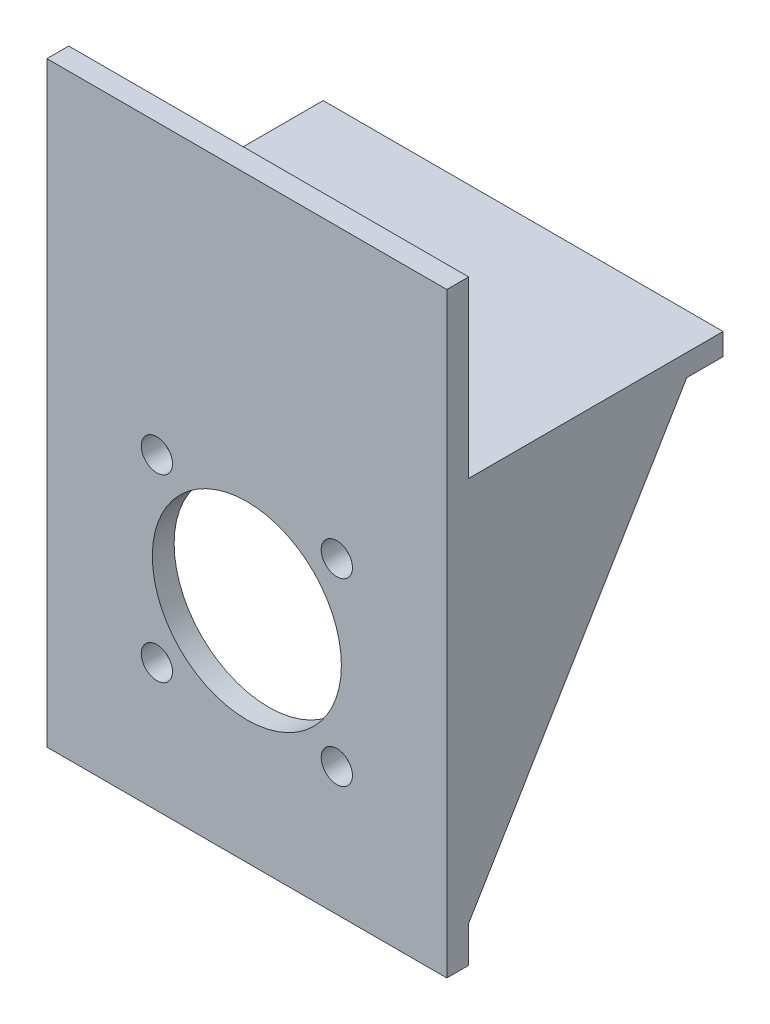
ISO-10303-21;
HEADER;
FILE_DESCRIPTION(('STEP AP214'),'2;1');
FILE_NAME('part.step','',(''),(''),'','','');
FILE_SCHEMA(('AUTOMOTIVE_DESIGN { 1 0 10303 214 1 1 1 1 }'));
ENDSEC;
DATA;
#1=APPLICATION_CONTEXT('core data for automotive mechanical design processes');
#2=APPLICATION_PROTOCOL_DEFINITION('international standard','automotive_design',2000,#1);
#3=PRODUCT_CONTEXT('',#1,'mechanical');
#4=PRODUCT('Part','Part','',(#3));
#5=PRODUCT_RELATED_PRODUCT_CATEGORY('part','',(#4));
#6=PRODUCT_DEFINITION_FORMATION('','',#4);
#7=PRODUCT_DEFINITION_CONTEXT('part definition',#1,'design');
#8=PRODUCT_DEFINITION('design','',#6,#7);
#9=PRODUCT_DEFINITION_SHAPE('','',#8);
#10=(LENGTH_UNIT() NAMED_UNIT(*) SI_UNIT(.MILLI.,.METRE.));
#11=(NAMED_UNIT(*) PLANE_ANGLE_UNIT() SI_UNIT($,.RADIAN.));
#12=(NAMED_UNIT(*) SI_UNIT($,.STERADIAN.) SOLID_ANGLE_UNIT());
#13=UNCERTAINTY_MEASURE_WITH_UNIT(LENGTH_MEASURE(1.E-05),#10,'distance_accuracy_value','');
#14=(GEOMETRIC_REPRESENTATION_CONTEXT(3) GLOBAL_UNCERTAINTY_ASSIGNED_CONTEXT((#13)) GLOBAL_UNIT_ASSIGNED_CONTEXT((#10,
#11,#12)) REPRESENTATION_CONTEXT('',''));
#15=CARTESIAN_POINT('',(0.,0.,0.));
#16=DIRECTION('',(0.,0.,1.));
#17=DIRECTION('',(1.,0.,0.));
#18=AXIS2_PLACEMENT_3D('',#15,#16,#17);
#19=CARTESIAN_POINT('',(-27.5,3.,-17.5));
#20=DIRECTION('',(1.,0.,0.));
#21=DIRECTION('',(0.,0.,-1.));
#22=AXIS2_PLACEMENT_3D('',#19,#20,#21);
#23=PLANE('',#22);
#24=DIRECTION('',(0.,0.,1.));
#25=VECTOR('',#24,1.);
#26=CARTESIAN_POINT('',(-27.5,0.,-17.5));
#27=LINE('',#26,#25);
#28=CARTESIAN_POINT('',(-27.5,0.,-17.5));
#29=VERTEX_POINT('',#28);
#30=CARTESIAN_POINT('',(-27.5,0.,-12.5));
#31=VERTEX_POINT('',#30);
#32=EDGE_CURVE('E217',#29,#31,#27,.T.);
#33=ORIENTED_EDGE('',*,*,#32,.T.);
#34=DIRECTION('',(0.,-0.857492925712544,0.514495755427526));
#35=VECTOR('',#34,1.);
#36=CARTESIAN_POINT('',(-27.5,-50.,17.5));
#37=LINE('',#36,#35);
#38=CARTESIAN_POINT('',(-27.5,-50.,17.5));
#39=VERTEX_POINT('',#38);
#40=EDGE_CURVE('E50',#31,#39,#37,.T.);
#41=ORIENTED_EDGE('',*,*,#40,.T.);
#42=DIRECTION('',(0.,-1.,0.));
#43=VECTOR('',#42,1.);
#44=CARTESIAN_POINT('',(-27.5,27.,17.5));
#45=LINE('',#44,#43);
#46=CARTESIAN_POINT('',(-27.5,-55.,17.5));
#47=VERTEX_POINT('',#46);
#48=EDGE_CURVE('E152',#39,#47,#45,.T.);
#49=ORIENTED_EDGE('',*,*,#48,.T.);
#50=DIRECTION('',(0.,0.,-1.));
#51=VECTOR('',#50,1.);
#52=CARTESIAN_POINT('',(-27.5,-55.,20.5));
#53=LINE('',#52,#51);
#54=CARTESIAN_POINT('',(-27.5,-55.,20.5));
#55=VERTEX_POINT('',#54);
#56=EDGE_CURVE('E196',#55,#47,#53,.T.);
#57=ORIENTED_EDGE('',*,*,#56,.F.);
#58=DIRECTION('',(0.,-1.,0.));
#59=VECTOR('',#58,1.);
#60=CARTESIAN_POINT('',(-27.5,27.,20.5));
#61=LINE('',#60,#59);
#62=CARTESIAN_POINT('',(-27.5,27.,20.5));
#63=VERTEX_POINT('',#62);
#64=EDGE_CURVE('E174',#63,#55,#61,.T.);
#65=ORIENTED_EDGE('',*,*,#64,.F.);
#66=DIRECTION('',(0.,0.,-1.));
#67=VECTOR('',#66,1.);
#68=CARTESIAN_POINT('',(-27.5,27.,20.5));
#69=LINE('',#68,#67);
#70=CARTESIAN_POINT('',(-27.5,27.,17.5));
#71=VERTEX_POINT('',#70);
#72=EDGE_CURVE('E184',#63,#71,#69,.T.);
#73=ORIENTED_EDGE('',*,*,#72,.T.);
#74=CARTESIAN_POINT('',(-27.5,3.,17.5));
#75=VERTEX_POINT('',#74);
#76=EDGE_CURVE('E192',#71,#75,#45,.T.);
#77=ORIENTED_EDGE('',*,*,#76,.T.);
#78=DIRECTION('',(0.,0.,1.));
#79=VECTOR('',#78,1.);
#80=CARTESIAN_POINT('',(-27.5,3.,-17.5));
#81=LINE('',#80,#79);
#82=CARTESIAN_POINT('',(-27.5,3.,-17.5));
#83=VERTEX_POINT('',#82);
#84=EDGE_CURVE('E232',#83,#75,#81,.T.);
#85=ORIENTED_EDGE('',*,*,#84,.F.);
#86=DIRECTION('',(0.,-1.,0.));
#87=VECTOR('',#86,1.);
#88=CARTESIAN_POINT('',(-27.5,3.,-17.5));
#89=LINE('',#88,#87);
#90=EDGE_CURVE('E42',#83,#29,#89,.T.);
#91=ORIENTED_EDGE('',*,*,#90,.T.);
#92=EDGE_LOOP('',(#33,#41,#49,#57,#65,#73,#77,#85,#91));
#93=FACE_BOUND('',#92,.T.);
#94=ADVANCED_FACE('F33',(#93),#23,.F.);
#95=CARTESIAN_POINT('',(27.5,3.,-17.5));
#96=DIRECTION('',(-1.,0.,0.));
#97=DIRECTION('',(0.,0.,1.));
#98=AXIS2_PLACEMENT_3D('',#95,#96,#97);
#99=PLANE('',#98);
#100=DIRECTION('',(0.,0.857492925712544,-0.514495755427526));
#101=VECTOR('',#100,1.);
#102=CARTESIAN_POINT('',(27.5,0.,-12.5));
#103=LINE('',#102,#101);
#104=CARTESIAN_POINT('',(27.5,-50.,17.5));
#105=VERTEX_POINT('',#104);
#106=CARTESIAN_POINT('',(27.5,0.,-12.5));
#107=VERTEX_POINT('',#106);
#108=EDGE_CURVE('E154',#105,#107,#103,.T.);
#109=ORIENTED_EDGE('',*,*,#108,.T.);
#110=DIRECTION('',(0.,0.,-1.));
#111=VECTOR('',#110,1.);
#112=CARTESIAN_POINT('',(27.5,0.,-17.5));
#113=LINE('',#112,#111);
#114=CARTESIAN_POINT('',(27.5,0.,-17.5));
#115=VERTEX_POINT('',#114);
#116=EDGE_CURVE('E222',#107,#115,#113,.T.);
#117=ORIENTED_EDGE('',*,*,#116,.T.);
#118=DIRECTION('',(0.,-1.,0.));
#119=VECTOR('',#118,1.);
#120=CARTESIAN_POINT('',(27.5,3.,-17.5));
#121=LINE('',#120,#119);
#122=CARTESIAN_POINT('',(27.5,3.,-17.5));
#123=VERTEX_POINT('',#122);
#124=EDGE_CURVE('E11',#123,#115,#121,.T.);
#125=ORIENTED_EDGE('',*,*,#124,.F.);
#126=DIRECTION('',(0.,0.,-1.));
#127=VECTOR('',#126,1.);
#128=CARTESIAN_POINT('',(27.5,3.,-17.5));
#129=LINE('',#128,#127);
#130=CARTESIAN_POINT('',(27.5,3.,17.5));
#131=VERTEX_POINT('',#130);
#132=EDGE_CURVE('E240',#131,#123,#129,.T.);
#133=ORIENTED_EDGE('',*,*,#132,.F.);
#134=DIRECTION('',(0.,1.,0.));
#135=VECTOR('',#134,1.);
#136=CARTESIAN_POINT('',(27.5,27.,17.5));
#137=LINE('',#136,#135);
#138=CARTESIAN_POINT('',(27.5,27.,17.5));
#139=VERTEX_POINT('',#138);
#140=EDGE_CURVE('E79',#131,#139,#137,.T.);
#141=ORIENTED_EDGE('',*,*,#140,.T.);
#142=DIRECTION('',(0.,0.,-1.));
#143=VECTOR('',#142,1.);
#144=CARTESIAN_POINT('',(27.5,27.,20.5));
#145=LINE('',#144,#143);
#146=CARTESIAN_POINT('',(27.5,27.,20.5));
#147=VERTEX_POINT('',#146);
#148=EDGE_CURVE('E208',#147,#139,#145,.T.);
#149=ORIENTED_EDGE('',*,*,#148,.F.);
#150=DIRECTION('',(0.,1.,0.));
#151=VECTOR('',#150,1.);
#152=CARTESIAN_POINT('',(27.5,27.,20.5));
#153=LINE('',#152,#151);
#154=CARTESIAN_POINT('',(27.5,-55.,20.5));
#155=VERTEX_POINT('',#154);
#156=EDGE_CURVE('E180',#155,#147,#153,.T.);
#157=ORIENTED_EDGE('',*,*,#156,.F.);
#158=DIRECTION('',(0.,0.,-1.));
#159=VECTOR('',#158,1.);
#160=CARTESIAN_POINT('',(27.5,-55.,20.5));
#161=LINE('',#160,#159);
#162=CARTESIAN_POINT('',(27.5,-55.,17.5));
#163=VERTEX_POINT('',#162);
#164=EDGE_CURVE('E210',#155,#163,#161,.T.);
#165=ORIENTED_EDGE('',*,*,#164,.T.);
#166=EDGE_CURVE('E198',#163,#105,#137,.T.);
#167=ORIENTED_EDGE('',*,*,#166,.T.);
#168=EDGE_LOOP('',(#109,#117,#125,#133,#141,#149,#157,#165,#167));
#169=FACE_BOUND('',#168,.T.);
#170=ADVANCED_FACE('F245',(#169),#99,.F.);
#171=CARTESIAN_POINT('',(-27.5,3.,-17.5));
#172=DIRECTION('',(0.,0.,1.));
#173=DIRECTION('',(1.,0.,0.));
#174=AXIS2_PLACEMENT_3D('',#171,#172,#173);
#175=PLANE('',#174);
#176=DIRECTION('',(-1.,0.,0.));
#177=VECTOR('',#176,1.);
#178=CARTESIAN_POINT('',(-27.5,0.,-17.5));
#179=LINE('',#178,#177);
#180=EDGE_CURVE('E72',#115,#29,#179,.T.);
#181=ORIENTED_EDGE('',*,*,#180,.T.);
#182=ORIENTED_EDGE('',*,*,#90,.F.);
#183=DIRECTION('',(-1.,0.,0.));
#184=VECTOR('',#183,1.);
#185=CARTESIAN_POINT('',(-27.5,3.,-17.5));
#186=LINE('',#185,#184);
#187=EDGE_CURVE('E59',#123,#83,#186,.T.);
#188=ORIENTED_EDGE('',*,*,#187,.F.);
#189=ORIENTED_EDGE('',*,*,#124,.T.);
#190=EDGE_LOOP('',(#181,#182,#188,#189));
#191=FACE_BOUND('',#190,.T.);
#192=ADVANCED_FACE('F246',(#191),#175,.F.);
#193=CARTESIAN_POINT('',(0.,3.,0.));
#194=DIRECTION('',(0.,1.,0.));
#195=DIRECTION('',(0.,0.,1.));
#196=AXIS2_PLACEMENT_3D('',#193,#194,#195);
#197=PLANE('',#196);
#198=ORIENTED_EDGE('',*,*,#84,.T.);
#199=DIRECTION('',(1.,0.,0.));
#200=VECTOR('',#199,1.);
#201=CARTESIAN_POINT('',(-27.5,3.,17.5));
#202=LINE('',#201,#200);
#203=EDGE_CURVE('E234',#75,#131,#202,.T.);
#204=ORIENTED_EDGE('',*,*,#203,.T.);
#205=ORIENTED_EDGE('',*,*,#132,.T.);
#206=ORIENTED_EDGE('',*,*,#187,.T.);
#207=EDGE_LOOP('',(#198,#204,#205,#206));
#208=FACE_BOUND('',#207,.T.);
#209=ADVANCED_FACE('F244',(#208),#197,.T.);
#210=CARTESIAN_POINT('',(0.,0.,0.));
#211=DIRECTION('',(0.,1.,0.));
#212=DIRECTION('',(0.,0.,1.));
#213=AXIS2_PLACEMENT_3D('',#210,#211,#212);
#214=PLANE('',#213);
#215=DIRECTION('',(0.,0.,-1.));
#216=VECTOR('',#215,1.);
#217=CARTESIAN_POINT('',(-24.5,0.,-12.5));
#218=LINE('',#217,#216);
#219=CARTESIAN_POINT('',(-24.5,0.,17.5));
#220=VERTEX_POINT('',#219);
#221=CARTESIAN_POINT('',(-24.5,0.,-12.5));
#222=VERTEX_POINT('',#221);
#223=EDGE_CURVE('E138',#220,#222,#218,.T.);
#224=ORIENTED_EDGE('',*,*,#223,.T.);
#225=DIRECTION('',(-1.,0.,0.));
#226=VECTOR('',#225,1.);
#227=CARTESIAN_POINT('',(-24.5,0.,-12.5));
#228=LINE('',#227,#226);
#229=EDGE_CURVE('E148',#222,#31,#228,.T.);
#230=ORIENTED_EDGE('',*,*,#229,.T.);
#231=ORIENTED_EDGE('',*,*,#32,.F.);
#232=ORIENTED_EDGE('',*,*,#180,.F.);
#233=ORIENTED_EDGE('',*,*,#116,.F.);
#234=DIRECTION('',(1.,0.,0.));
#235=VECTOR('',#234,1.);
#236=CARTESIAN_POINT('',(24.5,0.,-12.5));
#237=LINE('',#236,#235);
#238=CARTESIAN_POINT('',(24.5,0.,-12.5));
#239=VERTEX_POINT('',#238);
#240=EDGE_CURVE('E170',#239,#107,#237,.T.);
#241=ORIENTED_EDGE('',*,*,#240,.F.);
#242=DIRECTION('',(0.,0.,1.));
#243=VECTOR('',#242,1.);
#244=CARTESIAN_POINT('',(24.5,0.,17.5));
#245=LINE('',#244,#243);
#246=CARTESIAN_POINT('',(24.5,0.,17.5));
#247=VERTEX_POINT('',#246);
#248=EDGE_CURVE('E164',#239,#247,#245,.T.);
#249=ORIENTED_EDGE('',*,*,#248,.T.);
#250=DIRECTION('',(1.,0.,0.));
#251=VECTOR('',#250,1.);
#252=CARTESIAN_POINT('',(-27.5,0.,17.5));
#253=LINE('',#252,#251);
#254=EDGE_CURVE('E36',#220,#247,#253,.T.);
#255=ORIENTED_EDGE('',*,*,#254,.F.);
#256=EDGE_LOOP('',(#224,#230,#231,#232,#233,#241,#249,#255));
#257=FACE_BOUND('',#256,.T.);
#258=ADVANCED_FACE('F260',(#257),#214,.F.);
#259=CARTESIAN_POINT('',(0.,0.,17.5));
#260=DIRECTION('',(0.,0.,1.));
#261=DIRECTION('',(1.,0.,0.));
#262=AXIS2_PLACEMENT_3D('',#259,#260,#261);
#263=PLANE('',#262);
#264=CARTESIAN_POINT('',(12.3743686707645,-12.6256313292361,17.5));
#265=DIRECTION('',(0.,0.,-1.));
#266=DIRECTION('',(-1.,0.,0.));
#267=AXIS2_PLACEMENT_3D('',#264,#265,#266);
#268=CIRCLE('',#267,2.15);
#269=CARTESIAN_POINT('',(10.2243686707645,-12.6256313292361,17.5));
#270=VERTEX_POINT('',#269);
#271=EDGE_CURVE('E335',#270,#270,#268,.T.);
#272=ORIENTED_EDGE('',*,*,#271,.F.);
#273=EDGE_LOOP('',(#272));
#274=FACE_BOUND('',#273,.T.);
#275=CARTESIAN_POINT('',(12.3743686707639,-37.3743686707653,17.5));
#276=DIRECTION('',(0.,0.,-1.));
#277=DIRECTION('',(-1.,0.,0.));
#278=AXIS2_PLACEMENT_3D('',#275,#276,#277);
#279=CIRCLE('',#278,2.15);
#280=CARTESIAN_POINT('',(10.2243686707639,-37.3743686707653,17.5));
#281=VERTEX_POINT('',#280);
#282=EDGE_CURVE('E331',#281,#281,#279,.T.);
#283=ORIENTED_EDGE('',*,*,#282,.F.);
#284=EDGE_LOOP('',(#283));
#285=FACE_BOUND('',#284,.T.);
#286=CARTESIAN_POINT('',(-12.3743686707653,-37.3743686707646,17.5));
#287=DIRECTION('',(0.,0.,-1.));
#288=DIRECTION('',(-1.,0.,0.));
#289=AXIS2_PLACEMENT_3D('',#286,#287,#288);
#290=CIRCLE('',#289,2.15);
#291=CARTESIAN_POINT('',(-14.5243686707653,-37.3743686707646,17.5));
#292=VERTEX_POINT('',#291);
#293=EDGE_CURVE('E327',#292,#292,#290,.T.);
#294=ORIENTED_EDGE('',*,*,#293,.F.);
#295=EDGE_LOOP('',(#294));
#296=FACE_BOUND('',#295,.T.);
#297=CARTESIAN_POINT('',(-12.3743686707645,-12.6256313292353,17.5));
#298=DIRECTION('',(0.,0.,-1.));
#299=DIRECTION('',(-1.,0.,0.));
#300=AXIS2_PLACEMENT_3D('',#297,#298,#299);
#301=CIRCLE('',#300,2.15);
#302=CARTESIAN_POINT('',(-14.5243686707645,-12.6256313292353,17.5));
#303=VERTEX_POINT('',#302);
#304=EDGE_CURVE('E323',#303,#303,#301,.T.);
#305=ORIENTED_EDGE('',*,*,#304,.F.);
#306=EDGE_LOOP('',(#305));
#307=FACE_BOUND('',#306,.T.);
#308=CARTESIAN_POINT('',(0.,-25.,17.5));
#309=DIRECTION('',(0.,0.,-1.));
#310=DIRECTION('',(-1.,0.,0.));
#311=AXIS2_PLACEMENT_3D('',#308,#309,#310);
#312=CIRCLE('',#311,13.);
#313=CARTESIAN_POINT('',(-13.,-25.,17.5));
#314=VERTEX_POINT('',#313);
#315=EDGE_CURVE('E318',#314,#314,#312,.T.);
#316=ORIENTED_EDGE('',*,*,#315,.F.);
#317=EDGE_LOOP('',(#316));
#318=FACE_BOUND('',#317,.T.);
#319=ORIENTED_EDGE('',*,*,#48,.F.);
#320=DIRECTION('',(-1.,0.,0.));
#321=VECTOR('',#320,1.);
#322=CARTESIAN_POINT('',(-24.5,-50.,17.5));
#323=LINE('',#322,#321);
#324=CARTESIAN_POINT('',(-24.5,-50.,17.5));
#325=VERTEX_POINT('',#324);
#326=EDGE_CURVE('E145',#325,#39,#323,.T.);
#327=ORIENTED_EDGE('',*,*,#326,.F.);
#328=DIRECTION('',(0.,1.,0.));
#329=VECTOR('',#328,1.);
#330=CARTESIAN_POINT('',(-24.5,0.,17.5));
#331=LINE('',#330,#329);
#332=EDGE_CURVE('E133',#325,#220,#331,.T.);
#333=ORIENTED_EDGE('',*,*,#332,.T.);
#334=ORIENTED_EDGE('',*,*,#254,.T.);
#335=DIRECTION('',(0.,-1.,0.));
#336=VECTOR('',#335,1.);
#337=CARTESIAN_POINT('',(24.5,-50.,17.5));
#338=LINE('',#337,#336);
#339=CARTESIAN_POINT('',(24.5,-50.,17.5));
#340=VERTEX_POINT('',#339);
#341=EDGE_CURVE('E159',#247,#340,#338,.T.);
#342=ORIENTED_EDGE('',*,*,#341,.T.);
#343=DIRECTION('',(1.,0.,0.));
#344=VECTOR('',#343,1.);
#345=CARTESIAN_POINT('',(24.5,-50.,17.5));
#346=LINE('',#345,#344);
#347=EDGE_CURVE('E167',#340,#105,#346,.T.);
#348=ORIENTED_EDGE('',*,*,#347,.T.);
#349=ORIENTED_EDGE('',*,*,#166,.F.);
#350=DIRECTION('',(1.,0.,0.));
#351=VECTOR('',#350,1.);
#352=CARTESIAN_POINT('',(-27.5,-55.,17.5));
#353=LINE('',#352,#351);
#354=EDGE_CURVE('E187',#47,#163,#353,.T.);
#355=ORIENTED_EDGE('',*,*,#354,.F.);
#356=EDGE_LOOP('',(#319,#327,#333,#334,#342,#348,#349,#355));
#357=FACE_BOUND('',#356,.T.);
#358=ADVANCED_FACE('F150',(#274,#285,#296,#307,#318,#357),#263,.F.);
#359=CARTESIAN_POINT('',(-27.5,-55.,20.5));
#360=DIRECTION('',(0.,1.,0.));
#361=DIRECTION('',(0.,0.,1.));
#362=AXIS2_PLACEMENT_3D('',#359,#360,#361);
#363=PLANE('',#362);
#364=ORIENTED_EDGE('',*,*,#354,.T.);
#365=ORIENTED_EDGE('',*,*,#164,.F.);
#366=DIRECTION('',(1.,0.,0.));
#367=VECTOR('',#366,1.);
#368=CARTESIAN_POINT('',(-27.5,-55.,20.5));
#369=LINE('',#368,#367);
#370=EDGE_CURVE('E177',#55,#155,#369,.T.);
#371=ORIENTED_EDGE('',*,*,#370,.F.);
#372=ORIENTED_EDGE('',*,*,#56,.T.);
#373=EDGE_LOOP('',(#364,#365,#371,#372));
#374=FACE_BOUND('',#373,.T.);
#375=ADVANCED_FACE('F256',(#374),#363,.F.);
#376=CARTESIAN_POINT('',(-27.5,27.,20.5));
#377=DIRECTION('',(0.,-1.,0.));
#378=DIRECTION('',(0.,0.,-1.));
#379=AXIS2_PLACEMENT_3D('',#376,#377,#378);
#380=PLANE('',#379);
#381=DIRECTION('',(-1.,0.,0.));
#382=VECTOR('',#381,1.);
#383=CARTESIAN_POINT('',(-27.5,27.,17.5));
#384=LINE('',#383,#382);
#385=EDGE_CURVE('E178',#139,#71,#384,.T.);
#386=ORIENTED_EDGE('',*,*,#385,.T.);
#387=ORIENTED_EDGE('',*,*,#72,.F.);
#388=DIRECTION('',(-1.,0.,0.));
#389=VECTOR('',#388,1.);
#390=CARTESIAN_POINT('',(-27.5,27.,20.5));
#391=LINE('',#390,#389);
#392=EDGE_CURVE('E182',#147,#63,#391,.T.);
#393=ORIENTED_EDGE('',*,*,#392,.F.);
#394=ORIENTED_EDGE('',*,*,#148,.T.);
#395=EDGE_LOOP('',(#386,#387,#393,#394));
#396=FACE_BOUND('',#395,.T.);
#397=ADVANCED_FACE('F253',(#396),#380,.F.);
#398=CARTESIAN_POINT('',(0.,0.,20.5));
#399=DIRECTION('',(0.,0.,1.));
#400=DIRECTION('',(1.,0.,0.));
#401=AXIS2_PLACEMENT_3D('',#398,#399,#400);
#402=PLANE('',#401);
#403=CARTESIAN_POINT('',(12.3743686707645,-12.6256313292361,20.5));
#404=DIRECTION('',(0.,0.,-1.));
#405=DIRECTION('',(-1.,0.,0.));
#406=AXIS2_PLACEMENT_3D('',#403,#404,#405);
#407=CIRCLE('',#406,2.15);
#408=CARTESIAN_POINT('',(10.2243686707645,-12.6256313292361,20.5));
#409=VERTEX_POINT('',#408);
#410=EDGE_CURVE('E300',#409,#409,#407,.T.);
#411=ORIENTED_EDGE('',*,*,#410,.T.);
#412=EDGE_LOOP('',(#411));
#413=FACE_BOUND('',#412,.T.);
#414=CARTESIAN_POINT('',(12.3743686707639,-37.3743686707653,20.5));
#415=DIRECTION('',(0.,0.,-1.));
#416=DIRECTION('',(-1.,0.,0.));
#417=AXIS2_PLACEMENT_3D('',#414,#415,#416);
#418=CIRCLE('',#417,2.15);
#419=CARTESIAN_POINT('',(10.2243686707639,-37.3743686707653,20.5));
#420=VERTEX_POINT('',#419);
#421=EDGE_CURVE('E304',#420,#420,#418,.T.);
#422=ORIENTED_EDGE('',*,*,#421,.T.);
#423=EDGE_LOOP('',(#422));
#424=FACE_BOUND('',#423,.T.);
#425=CARTESIAN_POINT('',(-12.3743686707653,-37.3743686707646,20.5));
#426=DIRECTION('',(0.,0.,-1.));
#427=DIRECTION('',(-1.,0.,0.));
#428=AXIS2_PLACEMENT_3D('',#425,#426,#427);
#429=CIRCLE('',#428,2.15);
#430=CARTESIAN_POINT('',(-14.5243686707653,-37.3743686707646,20.5));
#431=VERTEX_POINT('',#430);
#432=EDGE_CURVE('E308',#431,#431,#429,.T.);
#433=ORIENTED_EDGE('',*,*,#432,.T.);
#434=EDGE_LOOP('',(#433));
#435=FACE_BOUND('',#434,.T.);
#436=CARTESIAN_POINT('',(-12.3743686707645,-12.6256313292353,20.5));
#437=DIRECTION('',(0.,0.,-1.));
#438=DIRECTION('',(-1.,0.,0.));
#439=AXIS2_PLACEMENT_3D('',#436,#437,#438);
#440=CIRCLE('',#439,2.15);
#441=CARTESIAN_POINT('',(-14.5243686707645,-12.6256313292353,20.5));
#442=VERTEX_POINT('',#441);
#443=EDGE_CURVE('E312',#442,#442,#440,.T.);
#444=ORIENTED_EDGE('',*,*,#443,.T.);
#445=EDGE_LOOP('',(#444));
#446=FACE_BOUND('',#445,.T.);
#447=CARTESIAN_POINT('',(0.,-25.,20.5));
#448=DIRECTION('',(0.,0.,-1.));
#449=DIRECTION('',(-1.,0.,0.));
#450=AXIS2_PLACEMENT_3D('',#447,#448,#449);
#451=CIRCLE('',#450,13.);
#452=CARTESIAN_POINT('',(-13.,-25.,20.5));
#453=VERTEX_POINT('',#452);
#454=EDGE_CURVE('E316',#453,#453,#451,.T.);
#455=ORIENTED_EDGE('',*,*,#454,.T.);
#456=EDGE_LOOP('',(#455));
#457=FACE_BOUND('',#456,.T.);
#458=ORIENTED_EDGE('',*,*,#64,.T.);
#459=ORIENTED_EDGE('',*,*,#370,.T.);
#460=ORIENTED_EDGE('',*,*,#156,.T.);
#461=ORIENTED_EDGE('',*,*,#392,.T.);
#462=EDGE_LOOP('',(#458,#459,#460,#461));
#463=FACE_BOUND('',#462,.T.);
#464=ADVANCED_FACE('F274',(#413,#424,#435,#446,#457,#463),#402,.T.);
#465=ORIENTED_EDGE('',*,*,#203,.F.);
#466=ORIENTED_EDGE('',*,*,#76,.F.);
#467=ORIENTED_EDGE('',*,*,#385,.F.);
#468=ORIENTED_EDGE('',*,*,#140,.F.);
#469=EDGE_LOOP('',(#465,#466,#467,#468));
#470=FACE_BOUND('',#469,.T.);
#471=ADVANCED_FACE('F251',(#470),#263,.F.);
#472=CARTESIAN_POINT('',(24.5,0.,-12.5));
#473=DIRECTION('',(0.,-0.514495755427527,-0.857492925712544));
#474=DIRECTION('',(0.,0.857492925712544,-0.514495755427527));
#475=AXIS2_PLACEMENT_3D('',#472,#473,#474);
#476=PLANE('',#475);
#477=ORIENTED_EDGE('',*,*,#108,.F.);
#478=ORIENTED_EDGE('',*,*,#347,.F.);
#479=DIRECTION('',(0.,0.857492925712544,-0.514495755427526));
#480=VECTOR('',#479,1.);
#481=CARTESIAN_POINT('',(24.5,0.,-12.5));
#482=LINE('',#481,#480);
#483=EDGE_CURVE('E162',#340,#239,#482,.T.);
#484=ORIENTED_EDGE('',*,*,#483,.T.);
#485=ORIENTED_EDGE('',*,*,#240,.T.);
#486=EDGE_LOOP('',(#477,#478,#484,#485));
#487=FACE_BOUND('',#486,.T.);
#488=ADVANCED_FACE('F266',(#487),#476,.T.);
#489=CARTESIAN_POINT('',(24.5,0.,0.));
#490=DIRECTION('',(-1.,0.,0.));
#491=DIRECTION('',(0.,0.,1.));
#492=AXIS2_PLACEMENT_3D('',#489,#490,#491);
#493=PLANE('',#492);
#494=ORIENTED_EDGE('',*,*,#341,.F.);
#495=ORIENTED_EDGE('',*,*,#248,.F.);
#496=ORIENTED_EDGE('',*,*,#483,.F.);
#497=EDGE_LOOP('',(#494,#495,#496));
#498=FACE_BOUND('',#497,.T.);
#499=ADVANCED_FACE('F265',(#498),#493,.T.);
#500=CARTESIAN_POINT('',(-24.5,-50.,17.5));
#501=DIRECTION('',(0.,-0.514495755427527,-0.857492925712544));
#502=DIRECTION('',(0.,0.857492925712544,-0.514495755427527));
#503=AXIS2_PLACEMENT_3D('',#500,#501,#502);
#504=PLANE('',#503);
#505=ORIENTED_EDGE('',*,*,#40,.F.);
#506=ORIENTED_EDGE('',*,*,#229,.F.);
#507=DIRECTION('',(0.,-0.857492925712544,0.514495755427526));
#508=VECTOR('',#507,1.);
#509=CARTESIAN_POINT('',(-24.5,-50.,17.5));
#510=LINE('',#509,#508);
#511=EDGE_CURVE('E136',#222,#325,#510,.T.);
#512=ORIENTED_EDGE('',*,*,#511,.T.);
#513=ORIENTED_EDGE('',*,*,#326,.T.);
#514=EDGE_LOOP('',(#505,#506,#512,#513));
#515=FACE_BOUND('',#514,.T.);
#516=ADVANCED_FACE('F144',(#515),#504,.T.);
#517=CARTESIAN_POINT('',(-24.5,0.,0.));
#518=DIRECTION('',(1.,0.,0.));
#519=DIRECTION('',(0.,0.,-1.));
#520=AXIS2_PLACEMENT_3D('',#517,#518,#519);
#521=PLANE('',#520);
#522=ORIENTED_EDGE('',*,*,#511,.F.);
#523=ORIENTED_EDGE('',*,*,#223,.F.);
#524=ORIENTED_EDGE('',*,*,#332,.F.);
#525=EDGE_LOOP('',(#522,#523,#524));
#526=FACE_BOUND('',#525,.T.);
#527=ADVANCED_FACE('F135',(#526),#521,.T.);
#528=CARTESIAN_POINT('',(0.,-25.,20.5));
#529=DIRECTION('',(0.,0.,-1.));
#530=DIRECTION('',(-1.,0.,0.));
#531=AXIS2_PLACEMENT_3D('',#528,#529,#530);
#532=CYLINDRICAL_SURFACE('',#531,13.);
#533=ORIENTED_EDGE('',*,*,#454,.F.);
#534=EDGE_LOOP('',(#533));
#535=FACE_BOUND('',#534,.T.);
#536=ORIENTED_EDGE('',*,*,#315,.T.);
#537=EDGE_LOOP('',(#536));
#538=FACE_BOUND('',#537,.T.);
#539=ADVANCED_FACE('F352',(#535,#538),#532,.F.);
#540=CARTESIAN_POINT('',(-12.3743686707645,-12.6256313292353,20.5));
#541=DIRECTION('',(0.,0.,-1.));
#542=DIRECTION('',(-1.,0.,0.));
#543=AXIS2_PLACEMENT_3D('',#540,#541,#542);
#544=CYLINDRICAL_SURFACE('',#543,2.15);
#545=ORIENTED_EDGE('',*,*,#443,.F.);
#546=EDGE_LOOP('',(#545));
#547=FACE_BOUND('',#546,.T.);
#548=ORIENTED_EDGE('',*,*,#304,.T.);
#549=EDGE_LOOP('',(#548));
#550=FACE_BOUND('',#549,.T.);
#551=ADVANCED_FACE('F354',(#547,#550),#544,.F.);
#552=CARTESIAN_POINT('',(-12.3743686707653,-37.3743686707646,20.5));
#553=DIRECTION('',(0.,0.,-1.));
#554=DIRECTION('',(-1.,0.,0.));
#555=AXIS2_PLACEMENT_3D('',#552,#553,#554);
#556=CYLINDRICAL_SURFACE('',#555,2.15);
#557=ORIENTED_EDGE('',*,*,#432,.F.);
#558=EDGE_LOOP('',(#557));
#559=FACE_BOUND('',#558,.T.);
#560=ORIENTED_EDGE('',*,*,#293,.T.);
#561=EDGE_LOOP('',(#560));
#562=FACE_BOUND('',#561,.T.);
#563=ADVANCED_FACE('F360',(#559,#562),#556,.F.);
#564=CARTESIAN_POINT('',(12.3743686707639,-37.3743686707653,20.5));
#565=DIRECTION('',(0.,0.,-1.));
#566=DIRECTION('',(-1.,0.,0.));
#567=AXIS2_PLACEMENT_3D('',#564,#565,#566);
#568=CYLINDRICAL_SURFACE('',#567,2.15);
#569=ORIENTED_EDGE('',*,*,#421,.F.);
#570=EDGE_LOOP('',(#569));
#571=FACE_BOUND('',#570,.T.);
#572=ORIENTED_EDGE('',*,*,#282,.T.);
#573=EDGE_LOOP('',(#572));
#574=FACE_BOUND('',#573,.T.);
#575=ADVANCED_FACE('F409',(#571,#574),#568,.F.);
#576=CARTESIAN_POINT('',(12.3743686707645,-12.6256313292361,20.5));
#577=DIRECTION('',(0.,0.,-1.));
#578=DIRECTION('',(-1.,0.,0.));
#579=AXIS2_PLACEMENT_3D('',#576,#577,#578);
#580=CYLINDRICAL_SURFACE('',#579,2.15);
#581=ORIENTED_EDGE('',*,*,#410,.F.);
#582=EDGE_LOOP('',(#581));
#583=FACE_BOUND('',#582,.T.);
#584=ORIENTED_EDGE('',*,*,#271,.T.);
#585=EDGE_LOOP('',(#584));
#586=FACE_BOUND('',#585,.T.);
#587=ADVANCED_FACE('F340',(#583,#586),#580,.F.);
#588=CLOSED_SHELL('',(#94,#170,#192,#209,#258,#358,#375,#397,#464,#471,#488,#499,#516,#527,#539,
#551,#563,#575,#587));
#589=MANIFOLD_SOLID_BREP('B2',#588);
#590=ADVANCED_BREP_SHAPE_REPRESENTATION('',(#18,#589),#14);
#591=SHAPE_DEFINITION_REPRESENTATION(#9,#590);
ENDSEC;
END-ISO-10303-21;
